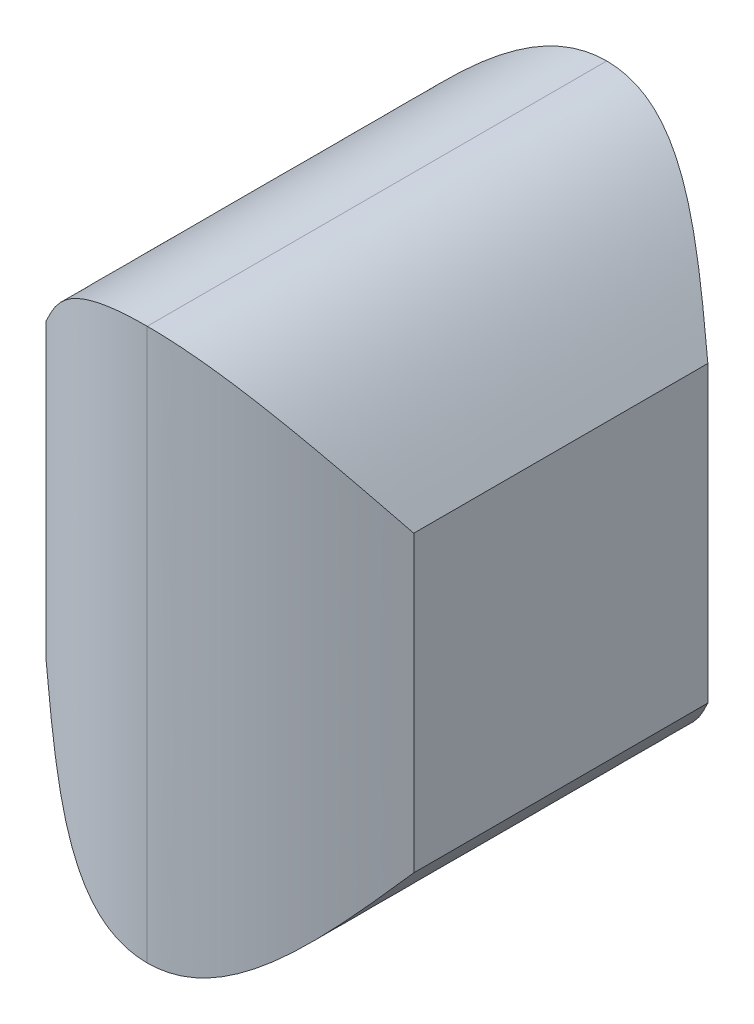
ISO-10303-21;
HEADER;
FILE_DESCRIPTION(('STEP AP214'),'2;1');
FILE_NAME('part.step','',(''),(''),'','','');
FILE_SCHEMA(('AUTOMOTIVE_DESIGN { 1 0 10303 214 1 1 1 1 }'));
ENDSEC;
DATA;
#1=APPLICATION_CONTEXT('core data for automotive mechanical design processes');
#2=APPLICATION_PROTOCOL_DEFINITION('international standard','automotive_design',2000,#1);
#3=PRODUCT_CONTEXT('',#1,'mechanical');
#4=PRODUCT('Part','Part','',(#3));
#5=PRODUCT_RELATED_PRODUCT_CATEGORY('part','',(#4));
#6=PRODUCT_DEFINITION_FORMATION('','',#4);
#7=PRODUCT_DEFINITION_CONTEXT('part definition',#1,'design');
#8=PRODUCT_DEFINITION('design','',#6,#7);
#9=PRODUCT_DEFINITION_SHAPE('','',#8);
#10=(LENGTH_UNIT() NAMED_UNIT(*) SI_UNIT(.MILLI.,.METRE.));
#11=(NAMED_UNIT(*) PLANE_ANGLE_UNIT() SI_UNIT($,.RADIAN.));
#12=(NAMED_UNIT(*) SI_UNIT($,.STERADIAN.) SOLID_ANGLE_UNIT());
#13=UNCERTAINTY_MEASURE_WITH_UNIT(LENGTH_MEASURE(1.E-05),#10,'distance_accuracy_value','');
#14=(GEOMETRIC_REPRESENTATION_CONTEXT(3) GLOBAL_UNCERTAINTY_ASSIGNED_CONTEXT((#13)) GLOBAL_UNIT_ASSIGNED_CONTEXT((#10,
#11,#12)) REPRESENTATION_CONTEXT('',''));
#15=CARTESIAN_POINT('',(0.,0.,0.));
#16=DIRECTION('',(0.,0.,1.));
#17=DIRECTION('',(1.,0.,0.));
#18=AXIS2_PLACEMENT_3D('',#15,#16,#17);
#19=CARTESIAN_POINT('',(300.,0.,0.));
#20=DIRECTION('',(1.,0.,0.));
#21=DIRECTION('',(0.,0.,-1.));
#22=AXIS2_PLACEMENT_3D('',#19,#20,#21);
#23=PLANE('',#22);
#24=DIRECTION('',(0.,0.,1.));
#25=VECTOR('',#24,1.);
#26=CARTESIAN_POINT('',(300.,115.,-102.5));
#27=LINE('',#26,#25);
#28=CARTESIAN_POINT('',(300.,115.,-102.5));
#29=VERTEX_POINT('',#28);
#30=CARTESIAN_POINT('',(300.,115.,-22.5));
#31=VERTEX_POINT('',#30);
#32=EDGE_CURVE('E326',#29,#31,#27,.T.);
#33=ORIENTED_EDGE('',*,*,#32,.F.);
#34=DIRECTION('',(0.,1.,0.));
#35=VECTOR('',#34,1.);
#36=CARTESIAN_POINT('',(300.,35.,-102.5));
#37=LINE('',#36,#35);
#38=CARTESIAN_POINT('',(300.,35.,-102.5));
#39=VERTEX_POINT('',#38);
#40=EDGE_CURVE('E398',#39,#29,#37,.T.);
#41=ORIENTED_EDGE('',*,*,#40,.F.);
#42=DIRECTION('',(0.,0.,-1.));
#43=VECTOR('',#42,1.);
#44=CARTESIAN_POINT('',(300.,35.,-22.5));
#45=LINE('',#44,#43);
#46=CARTESIAN_POINT('',(300.,35.,-22.5));
#47=VERTEX_POINT('',#46);
#48=EDGE_CURVE('E387',#47,#39,#45,.T.);
#49=ORIENTED_EDGE('',*,*,#48,.F.);
#50=DIRECTION('',(0.,-1.,0.));
#51=VECTOR('',#50,1.);
#52=CARTESIAN_POINT('',(300.,115.,-22.5));
#53=LINE('',#52,#51);
#54=EDGE_CURVE('E329',#31,#47,#53,.T.);
#55=ORIENTED_EDGE('',*,*,#54,.F.);
#56=EDGE_LOOP('',(#33,#41,#49,#55));
#57=FACE_BOUND('',#56,.T.);
#58=ADVANCED_FACE('F90',(#57),#23,.F.);
#59=CARTESIAN_POINT('',(300.,115.,-102.5));
#60=CARTESIAN_POINT('',(314.158656807285,132.5,-113.75));
#61=CARTESIAN_POINT('',(328.31731361457,150.,-125.));
#62=CARTESIAN_POINT('',(350.,150.,-125.));
#63=CARTESIAN_POINT('',(300.,115.,-75.8333333333333));
#64=CARTESIAN_POINT('',(314.158656807285,132.5,-79.5833333333333));
#65=CARTESIAN_POINT('',(328.31731361457,150.,-83.3333333333333));
#66=CARTESIAN_POINT('',(350.,150.,-83.3333333333333));
#67=CARTESIAN_POINT('',(300.,115.,-49.1666666666667));
#68=CARTESIAN_POINT('',(314.158656807285,132.5,-45.4166666666667));
#69=CARTESIAN_POINT('',(328.31731361457,150.,-41.6666666666667));
#70=CARTESIAN_POINT('',(350.,150.,-41.6666666666667));
#71=CARTESIAN_POINT('',(300.,115.,-22.5));
#72=CARTESIAN_POINT('',(314.158656807285,132.5,-11.25));
#73=CARTESIAN_POINT('',(328.31731361457,150.,0.));
#74=CARTESIAN_POINT('',(350.,150.,0.));
#75=B_SPLINE_SURFACE_WITH_KNOTS('',3,3,((#59,#60,#61,#62),(#63,#64,#65,#66),(#67,#68,#69,#70),
(#71,#72,#73,#74)),.UNSPECIFIED.,.F.,.F.,.F.,(4,4),(4,4),(0.,1.),(0.,1.),.UNSPECIFIED.);
#76=CARTESIAN_POINT('',(300.,115.,-22.5));
#77=CARTESIAN_POINT('',(314.158656807285,132.5,-11.25));
#78=CARTESIAN_POINT('',(328.31731361457,150.,0.));
#79=CARTESIAN_POINT('',(350.,150.,0.));
#80=B_SPLINE_CURVE_WITH_KNOTS('',3,(#76,#77,#78,#79),.UNSPECIFIED.,.F.,.F.,(4,4),(0.,1.),.UNSPECIFIED.);
#81=CARTESIAN_POINT('',(350.,150.,0.));
#82=VERTEX_POINT('',#81);
#83=EDGE_CURVE('E421',#31,#82,#80,.T.);
#84=DIRECTION('',(0.,0.,1.));
#85=VECTOR('',#84,1.);
#86=CARTESIAN_POINT('',(350.,150.,-125.));
#87=LINE('',#86,#85);
#88=CARTESIAN_POINT('',(350.,150.,-125.));
#89=VERTEX_POINT('',#88);
#90=EDGE_CURVE('E97',#89,#82,#87,.T.);
#91=CARTESIAN_POINT('',(300.,115.,-102.5));
#92=CARTESIAN_POINT('',(314.158656807285,132.5,-113.75));
#93=CARTESIAN_POINT('',(328.31731361457,150.,-125.));
#94=CARTESIAN_POINT('',(350.,150.,-125.));
#95=B_SPLINE_CURVE_WITH_KNOTS('',3,(#91,#92,#93,#94),.UNSPECIFIED.,.F.,.F.,(4,4),(0.,1.),.UNSPECIFIED.);
#96=EDGE_CURVE('E406',#89,#29,#95,.F.);
#97=ORIENTED_EDGE('',*,*,#32,.T.);
#98=ORIENTED_EDGE('',*,*,#83,.T.);
#99=ORIENTED_EDGE('',*,*,#90,.F.);
#100=ORIENTED_EDGE('',*,*,#96,.T.);
#101=EDGE_LOOP('',(#97,#98,#99,#100));
#102=FACE_BOUND('',#101,.T.);
#103=ADVANCED_FACE('F449',(#102),#75,.T.);
#104=CARTESIAN_POINT('',(300.,115.,-22.5));
#105=CARTESIAN_POINT('',(314.158656807285,132.5,-11.25));
#106=CARTESIAN_POINT('',(328.31731361457,150.,0.));
#107=CARTESIAN_POINT('',(350.,150.,0.));
#108=CARTESIAN_POINT('',(300.,88.3333333333333,-22.5));
#109=CARTESIAN_POINT('',(314.158656807285,94.1666666666667,-11.25));
#110=CARTESIAN_POINT('',(328.31731361457,100.,0.));
#111=CARTESIAN_POINT('',(350.,100.,0.));
#112=CARTESIAN_POINT('',(300.,61.6666666666667,-22.5));
#113=CARTESIAN_POINT('',(314.158656807285,55.8333333333333,-11.25));
#114=CARTESIAN_POINT('',(328.31731361457,50.,0.));
#115=CARTESIAN_POINT('',(350.,50.,0.));
#116=CARTESIAN_POINT('',(300.,35.,-22.5));
#117=CARTESIAN_POINT('',(314.158656807285,17.5,-11.25));
#118=CARTESIAN_POINT('',(328.31731361457,0.,0.));
#119=CARTESIAN_POINT('',(350.,0.,0.));
#120=B_SPLINE_SURFACE_WITH_KNOTS('',3,3,((#104,#105,#106,#107),(#108,#109,#110,#111),(#112,#113,
#114,#115),(#116,#117,#118,#119)),.UNSPECIFIED.,.F.,.F.,.F.,(4,4),(4,4),(0.,1.),(0.,1.),.UNSPECIFIED.);
#121=CARTESIAN_POINT('',(300.,35.,-22.5));
#122=CARTESIAN_POINT('',(314.158656807285,17.5,-11.25));
#123=CARTESIAN_POINT('',(328.31731361457,0.,0.));
#124=CARTESIAN_POINT('',(350.,0.,0.));
#125=B_SPLINE_CURVE_WITH_KNOTS('',3,(#121,#122,#123,#124),.UNSPECIFIED.,.F.,.F.,(4,4),(0.,1.),.UNSPECIFIED.);
#126=CARTESIAN_POINT('',(350.,0.,0.));
#127=VERTEX_POINT('',#126);
#128=EDGE_CURVE('E415',#47,#127,#125,.T.);
#129=DIRECTION('',(0.,-1.,0.));
#130=VECTOR('',#129,1.);
#131=CARTESIAN_POINT('',(350.,150.,0.));
#132=LINE('',#131,#130);
#133=EDGE_CURVE('E293',#82,#127,#132,.T.);
#134=ORIENTED_EDGE('',*,*,#54,.T.);
#135=ORIENTED_EDGE('',*,*,#128,.T.);
#136=ORIENTED_EDGE('',*,*,#133,.F.);
#137=ORIENTED_EDGE('',*,*,#83,.F.);
#138=EDGE_LOOP('',(#134,#135,#136,#137));
#139=FACE_BOUND('',#138,.T.);
#140=ADVANCED_FACE('F460',(#139),#120,.T.);
#141=CARTESIAN_POINT('',(300.,35.,-102.5));
#142=CARTESIAN_POINT('',(314.158656807285,17.5,-113.75));
#143=CARTESIAN_POINT('',(328.31731361457,0.,-125.));
#144=CARTESIAN_POINT('',(350.,0.,-125.));
#145=CARTESIAN_POINT('',(300.,61.6666666666667,-102.5));
#146=CARTESIAN_POINT('',(314.158656807285,55.8333333333333,-113.75));
#147=CARTESIAN_POINT('',(328.31731361457,50.,-125.));
#148=CARTESIAN_POINT('',(350.,50.,-125.));
#149=CARTESIAN_POINT('',(300.,88.3333333333333,-102.5));
#150=CARTESIAN_POINT('',(314.158656807285,94.1666666666667,-113.75));
#151=CARTESIAN_POINT('',(328.31731361457,100.,-125.));
#152=CARTESIAN_POINT('',(350.,100.,-125.));
#153=CARTESIAN_POINT('',(300.,115.,-102.5));
#154=CARTESIAN_POINT('',(314.158656807285,132.5,-113.75));
#155=CARTESIAN_POINT('',(328.31731361457,150.,-125.));
#156=CARTESIAN_POINT('',(350.,150.,-125.));
#157=B_SPLINE_SURFACE_WITH_KNOTS('',3,3,((#141,#142,#143,#144),(#145,#146,#147,#148),(#149,#150,
#151,#152),(#153,#154,#155,#156)),.UNSPECIFIED.,.F.,.F.,.F.,(4,4),(4,4),(0.,1.),(0.,1.),.UNSPECIFIED.);
#158=DIRECTION('',(0.,1.,0.));
#159=VECTOR('',#158,1.);
#160=CARTESIAN_POINT('',(350.,0.,-125.));
#161=LINE('',#160,#159);
#162=CARTESIAN_POINT('',(350.,0.,-125.));
#163=VERTEX_POINT('',#162);
#164=EDGE_CURVE('E12',#163,#89,#161,.T.);
#165=CARTESIAN_POINT('',(300.,35.,-102.5));
#166=CARTESIAN_POINT('',(314.158656807285,17.5,-113.75));
#167=CARTESIAN_POINT('',(328.31731361457,0.,-125.));
#168=CARTESIAN_POINT('',(350.,0.,-125.));
#169=B_SPLINE_CURVE_WITH_KNOTS('',3,(#165,#166,#167,#168),.UNSPECIFIED.,.F.,.F.,(4,4),(0.,1.),.UNSPECIFIED.);
#170=EDGE_CURVE('E111',#39,#163,#169,.T.);
#171=ORIENTED_EDGE('',*,*,#40,.T.);
#172=ORIENTED_EDGE('',*,*,#96,.F.);
#173=ORIENTED_EDGE('',*,*,#164,.F.);
#174=ORIENTED_EDGE('',*,*,#170,.F.);
#175=EDGE_LOOP('',(#171,#172,#173,#174));
#176=FACE_BOUND('',#175,.T.);
#177=ADVANCED_FACE('F418',(#176),#157,.T.);
#178=CARTESIAN_POINT('',(300.,35.,-22.5));
#179=CARTESIAN_POINT('',(314.158656807285,17.5,-11.25));
#180=CARTESIAN_POINT('',(328.31731361457,0.,0.));
#181=CARTESIAN_POINT('',(350.,0.,0.));
#182=CARTESIAN_POINT('',(300.,35.,-49.1666666666667));
#183=CARTESIAN_POINT('',(314.158656807285,17.5,-45.4166666666667));
#184=CARTESIAN_POINT('',(328.31731361457,0.,-41.6666666666667));
#185=CARTESIAN_POINT('',(350.,0.,-41.6666666666667));
#186=CARTESIAN_POINT('',(300.,35.,-75.8333333333333));
#187=CARTESIAN_POINT('',(314.158656807285,17.5,-79.5833333333333));
#188=CARTESIAN_POINT('',(328.31731361457,0.,-83.3333333333333));
#189=CARTESIAN_POINT('',(350.,0.,-83.3333333333333));
#190=CARTESIAN_POINT('',(300.,35.,-102.5));
#191=CARTESIAN_POINT('',(314.158656807285,17.5,-113.75));
#192=CARTESIAN_POINT('',(328.31731361457,0.,-125.));
#193=CARTESIAN_POINT('',(350.,0.,-125.));
#194=B_SPLINE_SURFACE_WITH_KNOTS('',3,3,((#178,#179,#180,#181),(#182,#183,#184,#185),(#186,#187,
#188,#189),(#190,#191,#192,#193)),.UNSPECIFIED.,.F.,.F.,.F.,(4,4),(4,4),(0.,1.),(0.,1.),.UNSPECIFIED.);
#195=DIRECTION('',(0.,0.,-1.));
#196=VECTOR('',#195,1.);
#197=CARTESIAN_POINT('',(350.,0.,0.));
#198=LINE('',#197,#196);
#199=EDGE_CURVE('E103',#127,#163,#198,.T.);
#200=ORIENTED_EDGE('',*,*,#48,.T.);
#201=ORIENTED_EDGE('',*,*,#170,.T.);
#202=ORIENTED_EDGE('',*,*,#199,.F.);
#203=ORIENTED_EDGE('',*,*,#128,.F.);
#204=EDGE_LOOP('',(#200,#201,#202,#203));
#205=FACE_BOUND('',#204,.T.);
#206=ADVANCED_FACE('F92',(#205),#194,.T.);
#207=CARTESIAN_POINT('',(400.,0.,0.));
#208=DIRECTION('',(-1.,0.,0.));
#209=DIRECTION('',(0.,0.,-1.));
#210=AXIS2_PLACEMENT_3D('',#207,#208,#209);
#211=PLANE('',#210);
#212=DIRECTION('',(0.,0.,1.));
#213=VECTOR('',#212,1.);
#214=CARTESIAN_POINT('',(400.,115.,-102.5));
#215=LINE('',#214,#213);
#216=CARTESIAN_POINT('',(400.,115.,-102.5));
#217=VERTEX_POINT('',#216);
#218=CARTESIAN_POINT('',(400.,115.,-22.5));
#219=VERTEX_POINT('',#218);
#220=EDGE_CURVE('E156',#217,#219,#215,.T.);
#221=ORIENTED_EDGE('',*,*,#220,.T.);
#222=DIRECTION('',(0.,-1.,0.));
#223=VECTOR('',#222,1.);
#224=CARTESIAN_POINT('',(400.,115.,-22.5));
#225=LINE('',#224,#223);
#226=CARTESIAN_POINT('',(400.,35.,-22.5));
#227=VERTEX_POINT('',#226);
#228=EDGE_CURVE('E166',#219,#227,#225,.T.);
#229=ORIENTED_EDGE('',*,*,#228,.T.);
#230=DIRECTION('',(0.,0.,-1.));
#231=VECTOR('',#230,1.);
#232=CARTESIAN_POINT('',(400.,35.,-22.5));
#233=LINE('',#232,#231);
#234=CARTESIAN_POINT('',(400.,35.,-102.5));
#235=VERTEX_POINT('',#234);
#236=EDGE_CURVE('E174',#227,#235,#233,.T.);
#237=ORIENTED_EDGE('',*,*,#236,.T.);
#238=DIRECTION('',(0.,1.,0.));
#239=VECTOR('',#238,1.);
#240=CARTESIAN_POINT('',(400.,35.,-102.5));
#241=LINE('',#240,#239);
#242=EDGE_CURVE('E182',#235,#217,#241,.T.);
#243=ORIENTED_EDGE('',*,*,#242,.T.);
#244=EDGE_LOOP('',(#221,#229,#237,#243));
#245=FACE_BOUND('',#244,.T.);
#246=ADVANCED_FACE('F180',(#245),#211,.F.);
#247=CARTESIAN_POINT('',(400.,115.,-102.5));
#248=CARTESIAN_POINT('',(385.841343192715,132.5,-113.75));
#249=CARTESIAN_POINT('',(371.68268638543,150.,-125.));
#250=CARTESIAN_POINT('',(350.,150.,-125.));
#251=CARTESIAN_POINT('',(400.,115.,-75.8333333333333));
#252=CARTESIAN_POINT('',(385.841343192715,132.5,-79.5833333333333));
#253=CARTESIAN_POINT('',(371.68268638543,150.,-83.3333333333333));
#254=CARTESIAN_POINT('',(350.,150.,-83.3333333333333));
#255=CARTESIAN_POINT('',(400.,115.,-49.1666666666667));
#256=CARTESIAN_POINT('',(385.841343192715,132.5,-45.4166666666667));
#257=CARTESIAN_POINT('',(371.68268638543,150.,-41.6666666666667));
#258=CARTESIAN_POINT('',(350.,150.,-41.6666666666667));
#259=CARTESIAN_POINT('',(400.,115.,-22.5));
#260=CARTESIAN_POINT('',(385.841343192715,132.5,-11.25));
#261=CARTESIAN_POINT('',(371.68268638543,150.,0.));
#262=CARTESIAN_POINT('',(350.,150.,0.));
#263=B_SPLINE_SURFACE_WITH_KNOTS('',3,3,((#247,#248,#249,#250),(#251,#252,#253,#254),(#255,#256,
#257,#258),(#259,#260,#261,#262)),.UNSPECIFIED.,.F.,.F.,.F.,(4,4),(4,4),(0.,1.),(0.,1.),.UNSPECIFIED.);
#264=CARTESIAN_POINT('',(400.,115.,-102.5));
#265=CARTESIAN_POINT('',(385.841343192715,132.5,-113.75));
#266=CARTESIAN_POINT('',(371.68268638543,150.,-125.));
#267=CARTESIAN_POINT('',(350.,150.,-125.));
#268=B_SPLINE_CURVE_WITH_KNOTS('',3,(#264,#265,#266,#267),.UNSPECIFIED.,.F.,.F.,(4,4),(0.,1.),.UNSPECIFIED.);
#269=EDGE_CURVE('E163',#89,#217,#268,.F.);
#270=CARTESIAN_POINT('',(400.,115.,-22.5));
#271=CARTESIAN_POINT('',(385.841343192715,132.5,-11.25));
#272=CARTESIAN_POINT('',(371.68268638543,150.,0.));
#273=CARTESIAN_POINT('',(350.,150.,0.));
#274=B_SPLINE_CURVE_WITH_KNOTS('',3,(#270,#271,#272,#273),.UNSPECIFIED.,.F.,.F.,(4,4),(0.,1.),.UNSPECIFIED.);
#275=EDGE_CURVE('E151',#219,#82,#274,.T.);
#276=ORIENTED_EDGE('',*,*,#220,.F.);
#277=ORIENTED_EDGE('',*,*,#269,.F.);
#278=ORIENTED_EDGE('',*,*,#90,.T.);
#279=ORIENTED_EDGE('',*,*,#275,.F.);
#280=EDGE_LOOP('',(#276,#277,#278,#279));
#281=FACE_BOUND('',#280,.T.);
#282=ADVANCED_FACE('F153',(#281),#263,.F.);
#283=CARTESIAN_POINT('',(400.,115.,-22.5));
#284=CARTESIAN_POINT('',(385.841343192715,132.5,-11.25));
#285=CARTESIAN_POINT('',(371.68268638543,150.,0.));
#286=CARTESIAN_POINT('',(350.,150.,0.));
#287=CARTESIAN_POINT('',(400.,88.3333333333333,-22.5));
#288=CARTESIAN_POINT('',(385.841343192715,94.1666666666667,-11.25));
#289=CARTESIAN_POINT('',(371.68268638543,100.,0.));
#290=CARTESIAN_POINT('',(350.,100.,0.));
#291=CARTESIAN_POINT('',(400.,61.6666666666667,-22.5));
#292=CARTESIAN_POINT('',(385.841343192715,55.8333333333333,-11.25));
#293=CARTESIAN_POINT('',(371.68268638543,50.,0.));
#294=CARTESIAN_POINT('',(350.,50.,0.));
#295=CARTESIAN_POINT('',(400.,35.,-22.5));
#296=CARTESIAN_POINT('',(385.841343192715,17.5,-11.25));
#297=CARTESIAN_POINT('',(371.68268638543,0.,0.));
#298=CARTESIAN_POINT('',(350.,0.,0.));
#299=B_SPLINE_SURFACE_WITH_KNOTS('',3,3,((#283,#284,#285,#286),(#287,#288,#289,#290),(#291,#292,
#293,#294),(#295,#296,#297,#298)),.UNSPECIFIED.,.F.,.F.,.F.,(4,4),(4,4),(0.,1.),(0.,1.),.UNSPECIFIED.);
#300=CARTESIAN_POINT('',(400.,35.,-22.5));
#301=CARTESIAN_POINT('',(385.841343192715,17.5,-11.25));
#302=CARTESIAN_POINT('',(371.68268638543,0.,0.));
#303=CARTESIAN_POINT('',(350.,0.,0.));
#304=B_SPLINE_CURVE_WITH_KNOTS('',3,(#300,#301,#302,#303),.UNSPECIFIED.,.F.,.F.,(4,4),(0.,1.),.UNSPECIFIED.);
#305=EDGE_CURVE('E162',#227,#127,#304,.T.);
#306=ORIENTED_EDGE('',*,*,#228,.F.);
#307=ORIENTED_EDGE('',*,*,#275,.T.);
#308=ORIENTED_EDGE('',*,*,#133,.T.);
#309=ORIENTED_EDGE('',*,*,#305,.F.);
#310=EDGE_LOOP('',(#306,#307,#308,#309));
#311=FACE_BOUND('',#310,.T.);
#312=ADVANCED_FACE('F168',(#311),#299,.F.);
#313=CARTESIAN_POINT('',(400.,35.,-102.5));
#314=CARTESIAN_POINT('',(385.841343192715,17.5,-113.75));
#315=CARTESIAN_POINT('',(371.68268638543,0.,-125.));
#316=CARTESIAN_POINT('',(350.,0.,-125.));
#317=CARTESIAN_POINT('',(400.,61.6666666666667,-102.5));
#318=CARTESIAN_POINT('',(385.841343192715,55.8333333333333,-113.75));
#319=CARTESIAN_POINT('',(371.68268638543,50.,-125.));
#320=CARTESIAN_POINT('',(350.,50.,-125.));
#321=CARTESIAN_POINT('',(400.,88.3333333333333,-102.5));
#322=CARTESIAN_POINT('',(385.841343192715,94.1666666666667,-113.75));
#323=CARTESIAN_POINT('',(371.68268638543,100.,-125.));
#324=CARTESIAN_POINT('',(350.,100.,-125.));
#325=CARTESIAN_POINT('',(400.,115.,-102.5));
#326=CARTESIAN_POINT('',(385.841343192715,132.5,-113.75));
#327=CARTESIAN_POINT('',(371.68268638543,150.,-125.));
#328=CARTESIAN_POINT('',(350.,150.,-125.));
#329=B_SPLINE_SURFACE_WITH_KNOTS('',3,3,((#313,#314,#315,#316),(#317,#318,#319,#320),(#321,#322,
#323,#324),(#325,#326,#327,#328)),.UNSPECIFIED.,.F.,.F.,.F.,(4,4),(4,4),(0.,1.),(0.,1.),.UNSPECIFIED.);
#330=CARTESIAN_POINT('',(400.,35.,-102.5));
#331=CARTESIAN_POINT('',(385.841343192715,17.5,-113.75));
#332=CARTESIAN_POINT('',(371.68268638543,0.,-125.));
#333=CARTESIAN_POINT('',(350.,0.,-125.));
#334=B_SPLINE_CURVE_WITH_KNOTS('',3,(#330,#331,#332,#333),.UNSPECIFIED.,.F.,.F.,(4,4),(0.,1.),.UNSPECIFIED.);
#335=EDGE_CURVE('E319',#235,#163,#334,.T.);
#336=ORIENTED_EDGE('',*,*,#242,.F.);
#337=ORIENTED_EDGE('',*,*,#335,.T.);
#338=ORIENTED_EDGE('',*,*,#164,.T.);
#339=ORIENTED_EDGE('',*,*,#269,.T.);
#340=EDGE_LOOP('',(#336,#337,#338,#339));
#341=FACE_BOUND('',#340,.T.);
#342=ADVANCED_FACE('F250',(#341),#329,.F.);
#343=CARTESIAN_POINT('',(400.,35.,-22.5));
#344=CARTESIAN_POINT('',(385.841343192715,17.5,-11.25));
#345=CARTESIAN_POINT('',(371.68268638543,0.,0.));
#346=CARTESIAN_POINT('',(350.,0.,0.));
#347=CARTESIAN_POINT('',(400.,35.,-49.1666666666667));
#348=CARTESIAN_POINT('',(385.841343192715,17.5,-45.4166666666667));
#349=CARTESIAN_POINT('',(371.68268638543,0.,-41.6666666666667));
#350=CARTESIAN_POINT('',(350.,0.,-41.6666666666667));
#351=CARTESIAN_POINT('',(400.,35.,-75.8333333333333));
#352=CARTESIAN_POINT('',(385.841343192715,17.5,-79.5833333333333));
#353=CARTESIAN_POINT('',(371.68268638543,0.,-83.3333333333333));
#354=CARTESIAN_POINT('',(350.,0.,-83.3333333333333));
#355=CARTESIAN_POINT('',(400.,35.,-102.5));
#356=CARTESIAN_POINT('',(385.841343192715,17.5,-113.75));
#357=CARTESIAN_POINT('',(371.68268638543,0.,-125.));
#358=CARTESIAN_POINT('',(350.,0.,-125.));
#359=B_SPLINE_SURFACE_WITH_KNOTS('',3,3,((#343,#344,#345,#346),(#347,#348,#349,#350),(#351,#352,
#353,#354),(#355,#356,#357,#358)),.UNSPECIFIED.,.F.,.F.,.F.,(4,4),(4,4),(0.,1.),(0.,1.),.UNSPECIFIED.);
#360=ORIENTED_EDGE('',*,*,#236,.F.);
#361=ORIENTED_EDGE('',*,*,#305,.T.);
#362=ORIENTED_EDGE('',*,*,#199,.T.);
#363=ORIENTED_EDGE('',*,*,#335,.F.);
#364=EDGE_LOOP('',(#360,#361,#362,#363));
#365=FACE_BOUND('',#364,.T.);
#366=ADVANCED_FACE('F238',(#365),#359,.F.);
#367=CLOSED_SHELL('',(#58,#103,#140,#177,#206,#246,#282,#312,#342,#366));
#368=MANIFOLD_SOLID_BREP('B2',#367);
#369=ADVANCED_BREP_SHAPE_REPRESENTATION('',(#18,#368),#14);
#370=SHAPE_DEFINITION_REPRESENTATION(#9,#369);
ENDSEC;
END-ISO-10303-21;
